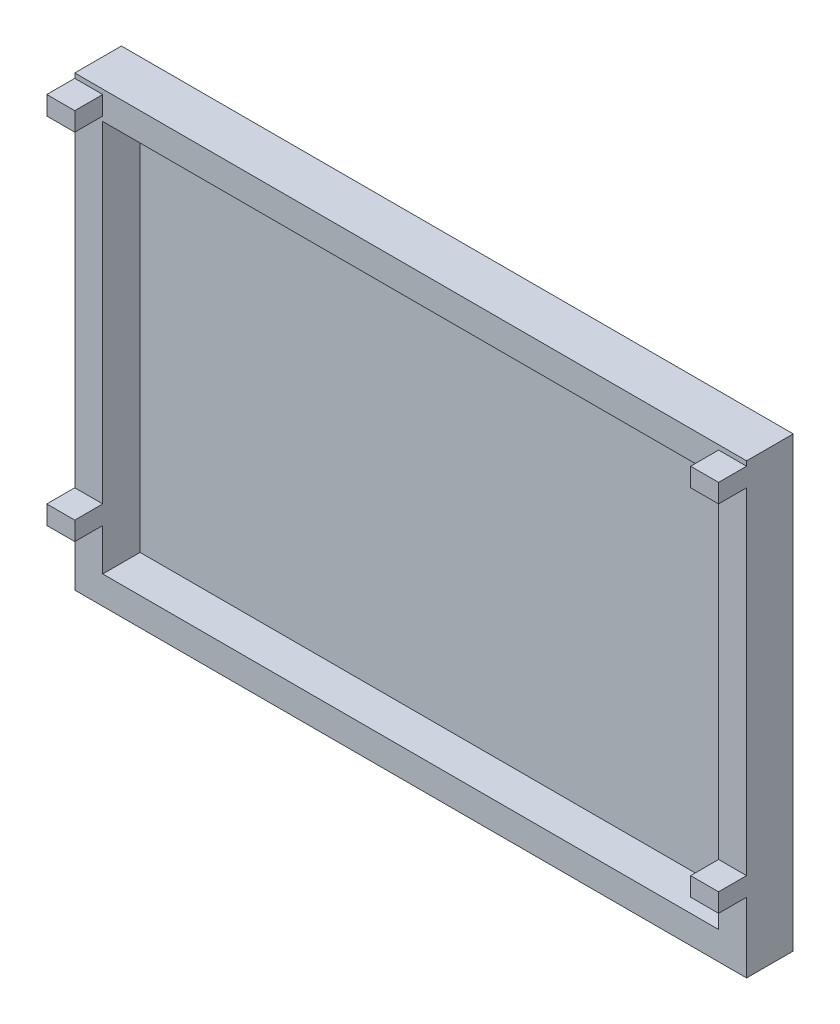
ISO-10303-21;
HEADER;
FILE_DESCRIPTION(('STEP AP214'),'2;1');
FILE_NAME('part.step','',(''),(''),'','','');
FILE_SCHEMA(('AUTOMOTIVE_DESIGN { 1 0 10303 214 1 1 1 1 }'));
ENDSEC;
DATA;
#1=APPLICATION_CONTEXT('core data for automotive mechanical design processes');
#2=APPLICATION_PROTOCOL_DEFINITION('international standard','automotive_design',2000,#1);
#3=PRODUCT_CONTEXT('',#1,'mechanical');
#4=PRODUCT('Part','Part','',(#3));
#5=PRODUCT_RELATED_PRODUCT_CATEGORY('part','',(#4));
#6=PRODUCT_DEFINITION_FORMATION('','',#4);
#7=PRODUCT_DEFINITION_CONTEXT('part definition',#1,'design');
#8=PRODUCT_DEFINITION('design','',#6,#7);
#9=PRODUCT_DEFINITION_SHAPE('','',#8);
#10=(LENGTH_UNIT() NAMED_UNIT(*) SI_UNIT(.MILLI.,.METRE.));
#11=(NAMED_UNIT(*) PLANE_ANGLE_UNIT() SI_UNIT($,.RADIAN.));
#12=(NAMED_UNIT(*) SI_UNIT($,.STERADIAN.) SOLID_ANGLE_UNIT());
#13=UNCERTAINTY_MEASURE_WITH_UNIT(LENGTH_MEASURE(1.E-05),#10,'distance_accuracy_value','');
#14=(GEOMETRIC_REPRESENTATION_CONTEXT(3) GLOBAL_UNCERTAINTY_ASSIGNED_CONTEXT((#13)) GLOBAL_UNIT_ASSIGNED_CONTEXT((#10,
#11,#12)) REPRESENTATION_CONTEXT('',''));
#15=CARTESIAN_POINT('',(0.,0.,0.));
#16=DIRECTION('',(0.,0.,1.));
#17=DIRECTION('',(1.,0.,0.));
#18=AXIS2_PLACEMENT_3D('',#15,#16,#17);
#19=CARTESIAN_POINT('',(0.,0.,127.));
#20=DIRECTION('',(0.,0.,1.));
#21=DIRECTION('',(1.,0.,0.));
#22=AXIS2_PLACEMENT_3D('',#19,#20,#21);
#23=PLANE('',#22);
#24=DIRECTION('',(0.,1.,0.));
#25=VECTOR('',#24,1.);
#26=CARTESIAN_POINT('',(1828.8,0.,127.));
#27=LINE('',#26,#25);
#28=CARTESIAN_POINT('',(1828.8,0.,127.));
#29=VERTEX_POINT('',#28);
#30=CARTESIAN_POINT('',(1828.8,190.5,127.));
#31=VERTEX_POINT('',#30);
#32=EDGE_CURVE('E354',#29,#31,#27,.T.);
#33=ORIENTED_EDGE('',*,*,#32,.T.);
#34=DIRECTION('',(1.,0.,0.));
#35=VECTOR('',#34,1.);
#36=CARTESIAN_POINT('',(1752.6,190.5,127.));
#37=LINE('',#36,#35);
#38=CARTESIAN_POINT('',(1752.6,190.5,127.));
#39=VERTEX_POINT('',#38);
#40=EDGE_CURVE('E556',#39,#31,#37,.T.);
#41=ORIENTED_EDGE('',*,*,#40,.F.);
#42=DIRECTION('',(0.,1.,0.));
#43=VECTOR('',#42,1.);
#44=CARTESIAN_POINT('',(1752.6,1143.,127.));
#45=LINE('',#44,#43);
#46=CARTESIAN_POINT('',(1752.6,76.2,127.));
#47=VERTEX_POINT('',#46);
#48=EDGE_CURVE('E218',#47,#39,#45,.T.);
#49=ORIENTED_EDGE('',*,*,#48,.F.);
#50=DIRECTION('',(1.,0.,0.));
#51=VECTOR('',#50,1.);
#52=CARTESIAN_POINT('',(1752.6,76.2,127.));
#53=LINE('',#52,#51);
#54=CARTESIAN_POINT('',(76.2000000000003,76.1999999999998,127.));
#55=VERTEX_POINT('',#54);
#56=EDGE_CURVE('E319',#55,#47,#53,.T.);
#57=ORIENTED_EDGE('',*,*,#56,.F.);
#58=DIRECTION('',(0.,-1.,0.));
#59=VECTOR('',#58,1.);
#60=CARTESIAN_POINT('',(76.2,1143.,127.));
#61=LINE('',#60,#59);
#62=CARTESIAN_POINT('',(76.2000000000002,190.5,127.));
#63=VERTEX_POINT('',#62);
#64=EDGE_CURVE('E333',#63,#55,#61,.T.);
#65=ORIENTED_EDGE('',*,*,#64,.F.);
#66=DIRECTION('',(1.,0.,0.));
#67=VECTOR('',#66,1.);
#68=CARTESIAN_POINT('',(0.,190.5,127.));
#69=LINE('',#68,#67);
#70=CARTESIAN_POINT('',(0.,190.5,127.));
#71=VERTEX_POINT('',#70);
#72=EDGE_CURVE('E219',#71,#63,#69,.T.);
#73=ORIENTED_EDGE('',*,*,#72,.F.);
#74=DIRECTION('',(0.,1.,0.));
#75=VECTOR('',#74,1.);
#76=CARTESIAN_POINT('',(0.,0.,127.));
#77=LINE('',#76,#75);
#78=CARTESIAN_POINT('',(0.,0.,127.));
#79=VERTEX_POINT('',#78);
#80=EDGE_CURVE('E369',#79,#71,#77,.T.);
#81=ORIENTED_EDGE('',*,*,#80,.F.);
#82=DIRECTION('',(1.,0.,0.));
#83=VECTOR('',#82,1.);
#84=CARTESIAN_POINT('',(0.,0.,127.));
#85=LINE('',#84,#83);
#86=EDGE_CURVE('E349',#79,#29,#85,.T.);
#87=ORIENTED_EDGE('',*,*,#86,.T.);
#88=EDGE_LOOP('',(#33,#41,#49,#57,#65,#73,#81,#87));
#89=FACE_BOUND('',#88,.T.);
#90=ADVANCED_FACE('F32',(#89),#23,.T.);
#91=CARTESIAN_POINT('',(1752.6,241.3,127.));
#92=VERTEX_POINT('',#91);
#93=CARTESIAN_POINT('',(1752.6,1143.,127.));
#94=VERTEX_POINT('',#93);
#95=EDGE_CURVE('E313',#92,#94,#45,.T.);
#96=ORIENTED_EDGE('',*,*,#95,.F.);
#97=DIRECTION('',(-1.,0.,0.));
#98=VECTOR('',#97,1.);
#99=CARTESIAN_POINT('',(1752.6,241.3,127.));
#100=LINE('',#99,#98);
#101=CARTESIAN_POINT('',(1828.8,241.3,127.));
#102=VERTEX_POINT('',#101);
#103=EDGE_CURVE('E213',#102,#92,#100,.T.);
#104=ORIENTED_EDGE('',*,*,#103,.F.);
#105=CARTESIAN_POINT('',(1828.8,1155.7,127.));
#106=VERTEX_POINT('',#105);
#107=EDGE_CURVE('E358',#102,#106,#27,.T.);
#108=ORIENTED_EDGE('',*,*,#107,.T.);
#109=DIRECTION('',(1.,0.,0.));
#110=VECTOR('',#109,1.);
#111=CARTESIAN_POINT('',(1752.6,1155.7,127.));
#112=LINE('',#111,#110);
#113=CARTESIAN_POINT('',(1752.6,1155.7,127.));
#114=VERTEX_POINT('',#113);
#115=EDGE_CURVE('E259',#114,#106,#112,.T.);
#116=ORIENTED_EDGE('',*,*,#115,.F.);
#117=DIRECTION('',(0.,-1.,0.));
#118=VECTOR('',#117,1.);
#119=CARTESIAN_POINT('',(1752.6,1206.5,127.));
#120=LINE('',#119,#118);
#121=CARTESIAN_POINT('',(1752.6,1206.5,127.));
#122=VERTEX_POINT('',#121);
#123=EDGE_CURVE('E245',#122,#114,#120,.T.);
#124=ORIENTED_EDGE('',*,*,#123,.F.);
#125=DIRECTION('',(-1.,0.,0.));
#126=VECTOR('',#125,1.);
#127=CARTESIAN_POINT('',(1752.6,1206.5,127.));
#128=LINE('',#127,#126);
#129=CARTESIAN_POINT('',(1828.8,1206.5,127.));
#130=VERTEX_POINT('',#129);
#131=EDGE_CURVE('E250',#130,#122,#128,.T.);
#132=ORIENTED_EDGE('',*,*,#131,.F.);
#133=CARTESIAN_POINT('',(1828.8,1219.2,127.));
#134=VERTEX_POINT('',#133);
#135=EDGE_CURVE('E352',#130,#134,#27,.T.);
#136=ORIENTED_EDGE('',*,*,#135,.T.);
#137=DIRECTION('',(1.,0.,0.));
#138=VECTOR('',#137,1.);
#139=CARTESIAN_POINT('',(0.,1219.2,127.));
#140=LINE('',#139,#138);
#141=CARTESIAN_POINT('',(0.,1219.2,127.));
#142=VERTEX_POINT('',#141);
#143=EDGE_CURVE('E357',#142,#134,#140,.T.);
#144=ORIENTED_EDGE('',*,*,#143,.F.);
#145=CARTESIAN_POINT('',(0.,1206.5,127.));
#146=VERTEX_POINT('',#145);
#147=EDGE_CURVE('E360',#146,#142,#77,.T.);
#148=ORIENTED_EDGE('',*,*,#147,.F.);
#149=DIRECTION('',(-1.,0.,0.));
#150=VECTOR('',#149,1.);
#151=CARTESIAN_POINT('',(0.,1206.5,127.));
#152=LINE('',#151,#150);
#153=CARTESIAN_POINT('',(76.2,1206.5,127.));
#154=VERTEX_POINT('',#153);
#155=EDGE_CURVE('E277',#154,#146,#152,.T.);
#156=ORIENTED_EDGE('',*,*,#155,.F.);
#157=DIRECTION('',(0.,1.,0.));
#158=VECTOR('',#157,1.);
#159=CARTESIAN_POINT('',(76.2,1206.5,127.));
#160=LINE('',#159,#158);
#161=CARTESIAN_POINT('',(76.2,1155.7,127.));
#162=VERTEX_POINT('',#161);
#163=EDGE_CURVE('E284',#162,#154,#160,.T.);
#164=ORIENTED_EDGE('',*,*,#163,.F.);
#165=DIRECTION('',(1.,0.,0.));
#166=VECTOR('',#165,1.);
#167=CARTESIAN_POINT('',(0.,1155.7,127.));
#168=LINE('',#167,#166);
#169=CARTESIAN_POINT('',(0.,1155.7,127.));
#170=VERTEX_POINT('',#169);
#171=EDGE_CURVE('E272',#170,#162,#168,.T.);
#172=ORIENTED_EDGE('',*,*,#171,.F.);
#173=CARTESIAN_POINT('',(0.,241.3,127.));
#174=VERTEX_POINT('',#173);
#175=EDGE_CURVE('E36',#174,#170,#77,.T.);
#176=ORIENTED_EDGE('',*,*,#175,.F.);
#177=DIRECTION('',(-1.,0.,0.));
#178=VECTOR('',#177,1.);
#179=CARTESIAN_POINT('',(0.,241.3,127.));
#180=LINE('',#179,#178);
#181=CARTESIAN_POINT('',(76.2,241.3,127.));
#182=VERTEX_POINT('',#181);
#183=EDGE_CURVE('E221',#182,#174,#180,.T.);
#184=ORIENTED_EDGE('',*,*,#183,.F.);
#185=CARTESIAN_POINT('',(76.2,1143.,127.));
#186=VERTEX_POINT('',#185);
#187=EDGE_CURVE('E334',#186,#182,#61,.T.);
#188=ORIENTED_EDGE('',*,*,#187,.F.);
#189=DIRECTION('',(-1.,0.,0.));
#190=VECTOR('',#189,1.);
#191=CARTESIAN_POINT('',(1752.6,1143.,127.));
#192=LINE('',#191,#190);
#193=EDGE_CURVE('E330',#94,#186,#192,.T.);
#194=ORIENTED_EDGE('',*,*,#193,.F.);
#195=EDGE_LOOP('',(#96,#104,#108,#116,#124,#132,#136,#144,#148,#156,#164,#172,#176,#184,#188,#194));
#196=FACE_BOUND('',#195,.T.);
#197=ADVANCED_FACE('F410',(#196),#23,.T.);
#198=CARTESIAN_POINT('',(0.,0.,127.));
#199=DIRECTION('',(0.,1.,0.));
#200=DIRECTION('',(0.,0.,1.));
#201=AXIS2_PLACEMENT_3D('',#198,#199,#200);
#202=PLANE('',#201);
#203=DIRECTION('',(1.,0.,0.));
#204=VECTOR('',#203,1.);
#205=CARTESIAN_POINT('',(0.,0.,0.));
#206=LINE('',#205,#204);
#207=CARTESIAN_POINT('',(0.,0.,0.));
#208=VERTEX_POINT('',#207);
#209=CARTESIAN_POINT('',(1828.8,0.,0.));
#210=VERTEX_POINT('',#209);
#211=EDGE_CURVE('E341',#208,#210,#206,.T.);
#212=ORIENTED_EDGE('',*,*,#211,.T.);
#213=DIRECTION('',(0.,0.,-1.));
#214=VECTOR('',#213,1.);
#215=CARTESIAN_POINT('',(1828.8,0.,127.));
#216=LINE('',#215,#214);
#217=EDGE_CURVE('E11',#29,#210,#216,.T.);
#218=ORIENTED_EDGE('',*,*,#217,.F.);
#219=ORIENTED_EDGE('',*,*,#86,.F.);
#220=DIRECTION('',(0.,0.,-1.));
#221=VECTOR('',#220,1.);
#222=CARTESIAN_POINT('',(0.,0.,127.));
#223=LINE('',#222,#221);
#224=EDGE_CURVE('E371',#79,#208,#223,.T.);
#225=ORIENTED_EDGE('',*,*,#224,.T.);
#226=EDGE_LOOP('',(#212,#218,#219,#225));
#227=FACE_BOUND('',#226,.T.);
#228=ADVANCED_FACE('F34',(#227),#202,.F.);
#229=CARTESIAN_POINT('',(1828.8,0.,127.));
#230=DIRECTION('',(-1.,0.,0.));
#231=DIRECTION('',(0.,0.,1.));
#232=AXIS2_PLACEMENT_3D('',#229,#230,#231);
#233=PLANE('',#232);
#234=DIRECTION('',(0.,1.,0.));
#235=VECTOR('',#234,1.);
#236=CARTESIAN_POINT('',(1828.8,0.,0.));
#237=LINE('',#236,#235);
#238=CARTESIAN_POINT('',(1828.8,1219.2,0.));
#239=VERTEX_POINT('',#238);
#240=EDGE_CURVE('E381',#210,#239,#237,.T.);
#241=ORIENTED_EDGE('',*,*,#240,.T.);
#242=DIRECTION('',(0.,0.,-1.));
#243=VECTOR('',#242,1.);
#244=CARTESIAN_POINT('',(1828.8,1219.2,127.));
#245=LINE('',#244,#243);
#246=EDGE_CURVE('E42',#134,#239,#245,.T.);
#247=ORIENTED_EDGE('',*,*,#246,.F.);
#248=ORIENTED_EDGE('',*,*,#135,.F.);
#249=DIRECTION('',(0.,0.,-1.));
#250=VECTOR('',#249,1.);
#251=CARTESIAN_POINT('',(1828.8,1206.5,203.2));
#252=LINE('',#251,#250);
#253=CARTESIAN_POINT('',(1828.8,1206.5,203.2));
#254=VERTEX_POINT('',#253);
#255=EDGE_CURVE('E265',#254,#130,#252,.T.);
#256=ORIENTED_EDGE('',*,*,#255,.F.);
#257=DIRECTION('',(0.,1.,0.));
#258=VECTOR('',#257,1.);
#259=CARTESIAN_POINT('',(1828.8,1206.5,203.2));
#260=LINE('',#259,#258);
#261=CARTESIAN_POINT('',(1828.8,1155.7,203.2));
#262=VERTEX_POINT('',#261);
#263=EDGE_CURVE('E252',#262,#254,#260,.T.);
#264=ORIENTED_EDGE('',*,*,#263,.F.);
#265=DIRECTION('',(0.,0.,-1.));
#266=VECTOR('',#265,1.);
#267=CARTESIAN_POINT('',(1828.8,1155.7,203.2));
#268=LINE('',#267,#266);
#269=EDGE_CURVE('E267',#262,#106,#268,.T.);
#270=ORIENTED_EDGE('',*,*,#269,.T.);
#271=ORIENTED_EDGE('',*,*,#107,.F.);
#272=DIRECTION('',(0.,0.,-1.));
#273=VECTOR('',#272,1.);
#274=CARTESIAN_POINT('',(1828.8,241.3,203.2));
#275=LINE('',#274,#273);
#276=CARTESIAN_POINT('',(1828.8,241.3,203.2));
#277=VERTEX_POINT('',#276);
#278=EDGE_CURVE('E223',#277,#102,#275,.T.);
#279=ORIENTED_EDGE('',*,*,#278,.F.);
#280=DIRECTION('',(0.,1.,0.));
#281=VECTOR('',#280,1.);
#282=CARTESIAN_POINT('',(1828.8,241.3,203.2));
#283=LINE('',#282,#281);
#284=CARTESIAN_POINT('',(1828.8,190.5,203.2));
#285=VERTEX_POINT('',#284);
#286=EDGE_CURVE('E207',#285,#277,#283,.T.);
#287=ORIENTED_EDGE('',*,*,#286,.F.);
#288=DIRECTION('',(0.,0.,-1.));
#289=VECTOR('',#288,1.);
#290=CARTESIAN_POINT('',(1828.8,190.5,203.2));
#291=LINE('',#290,#289);
#292=EDGE_CURVE('E204',#285,#31,#291,.T.);
#293=ORIENTED_EDGE('',*,*,#292,.T.);
#294=ORIENTED_EDGE('',*,*,#32,.F.);
#295=ORIENTED_EDGE('',*,*,#217,.T.);
#296=EDGE_LOOP('',(#241,#247,#248,#256,#264,#270,#271,#279,#287,#293,#294,#295));
#297=FACE_BOUND('',#296,.T.);
#298=ADVANCED_FACE('F400',(#297),#233,.F.);
#299=CARTESIAN_POINT('',(0.,1219.2,127.));
#300=DIRECTION('',(0.,1.,0.));
#301=DIRECTION('',(0.,0.,1.));
#302=AXIS2_PLACEMENT_3D('',#299,#300,#301);
#303=PLANE('',#302);
#304=DIRECTION('',(1.,0.,0.));
#305=VECTOR('',#304,1.);
#306=CARTESIAN_POINT('',(0.,1219.2,0.));
#307=LINE('',#306,#305);
#308=CARTESIAN_POINT('',(0.,1219.2,0.));
#309=VERTEX_POINT('',#308);
#310=EDGE_CURVE('E379',#309,#239,#307,.T.);
#311=ORIENTED_EDGE('',*,*,#310,.F.);
#312=DIRECTION('',(0.,0.,-1.));
#313=VECTOR('',#312,1.);
#314=CARTESIAN_POINT('',(0.,1219.2,127.));
#315=LINE('',#314,#313);
#316=EDGE_CURVE('E374',#142,#309,#315,.T.);
#317=ORIENTED_EDGE('',*,*,#316,.F.);
#318=ORIENTED_EDGE('',*,*,#143,.T.);
#319=ORIENTED_EDGE('',*,*,#246,.T.);
#320=EDGE_LOOP('',(#311,#317,#318,#319));
#321=FACE_BOUND('',#320,.T.);
#322=ADVANCED_FACE('F398',(#321),#303,.T.);
#323=CARTESIAN_POINT('',(0.,0.,127.));
#324=DIRECTION('',(-1.,0.,0.));
#325=DIRECTION('',(0.,0.,1.));
#326=AXIS2_PLACEMENT_3D('',#323,#324,#325);
#327=PLANE('',#326);
#328=DIRECTION('',(0.,1.,0.));
#329=VECTOR('',#328,1.);
#330=CARTESIAN_POINT('',(0.,0.,0.));
#331=LINE('',#330,#329);
#332=EDGE_CURVE('E353',#208,#309,#331,.T.);
#333=ORIENTED_EDGE('',*,*,#332,.F.);
#334=ORIENTED_EDGE('',*,*,#224,.F.);
#335=ORIENTED_EDGE('',*,*,#80,.T.);
#336=DIRECTION('',(0.,0.,-1.));
#337=VECTOR('',#336,1.);
#338=CARTESIAN_POINT('',(0.,190.5,203.2));
#339=LINE('',#338,#337);
#340=CARTESIAN_POINT('',(0.,190.5,203.2));
#341=VERTEX_POINT('',#340);
#342=EDGE_CURVE('E243',#341,#71,#339,.T.);
#343=ORIENTED_EDGE('',*,*,#342,.F.);
#344=DIRECTION('',(0.,-1.,0.));
#345=VECTOR('',#344,1.);
#346=CARTESIAN_POINT('',(0.,241.3,203.2));
#347=LINE('',#346,#345);
#348=CARTESIAN_POINT('',(0.,241.3,203.2));
#349=VERTEX_POINT('',#348);
#350=EDGE_CURVE('E227',#349,#341,#347,.T.);
#351=ORIENTED_EDGE('',*,*,#350,.F.);
#352=DIRECTION('',(0.,0.,-1.));
#353=VECTOR('',#352,1.);
#354=CARTESIAN_POINT('',(0.,241.3,203.2));
#355=LINE('',#354,#353);
#356=EDGE_CURVE('E235',#349,#174,#355,.T.);
#357=ORIENTED_EDGE('',*,*,#356,.T.);
#358=ORIENTED_EDGE('',*,*,#175,.T.);
#359=DIRECTION('',(0.,0.,-1.));
#360=VECTOR('',#359,1.);
#361=CARTESIAN_POINT('',(0.,1155.7,203.2));
#362=LINE('',#361,#360);
#363=CARTESIAN_POINT('',(0.,1155.7,203.2));
#364=VERTEX_POINT('',#363);
#365=EDGE_CURVE('E308',#364,#170,#362,.T.);
#366=ORIENTED_EDGE('',*,*,#365,.F.);
#367=DIRECTION('',(0.,-1.,0.));
#368=VECTOR('',#367,1.);
#369=CARTESIAN_POINT('',(0.,1206.5,203.2));
#370=LINE('',#369,#368);
#371=CARTESIAN_POINT('',(0.,1206.5,203.2));
#372=VERTEX_POINT('',#371);
#373=EDGE_CURVE('E273',#372,#364,#370,.T.);
#374=ORIENTED_EDGE('',*,*,#373,.F.);
#375=DIRECTION('',(0.,0.,-1.));
#376=VECTOR('',#375,1.);
#377=CARTESIAN_POINT('',(0.,1206.5,203.2));
#378=LINE('',#377,#376);
#379=EDGE_CURVE('E283',#372,#146,#378,.T.);
#380=ORIENTED_EDGE('',*,*,#379,.T.);
#381=ORIENTED_EDGE('',*,*,#147,.T.);
#382=ORIENTED_EDGE('',*,*,#316,.T.);
#383=EDGE_LOOP('',(#333,#334,#335,#343,#351,#357,#358,#366,#374,#380,#381,#382));
#384=FACE_BOUND('',#383,.T.);
#385=ADVANCED_FACE('F393',(#384),#327,.T.);
#386=CARTESIAN_POINT('',(0.,0.,0.));
#387=DIRECTION('',(0.,0.,1.));
#388=DIRECTION('',(1.,0.,0.));
#389=AXIS2_PLACEMENT_3D('',#386,#387,#388);
#390=PLANE('',#389);
#391=ORIENTED_EDGE('',*,*,#211,.F.);
#392=ORIENTED_EDGE('',*,*,#332,.T.);
#393=ORIENTED_EDGE('',*,*,#310,.T.);
#394=ORIENTED_EDGE('',*,*,#240,.F.);
#395=EDGE_LOOP('',(#391,#392,#393,#394));
#396=FACE_BOUND('',#395,.T.);
#397=ADVANCED_FACE('F392',(#396),#390,.F.);
#398=CARTESIAN_POINT('',(1752.6,1143.,25.4));
#399=DIRECTION('',(1.,0.,0.));
#400=DIRECTION('',(0.,1.,0.));
#401=AXIS2_PLACEMENT_3D('',#398,#399,#400);
#402=PLANE('',#401);
#403=ORIENTED_EDGE('',*,*,#48,.T.);
#404=DIRECTION('',(0.,0.,-1.));
#405=VECTOR('',#404,1.);
#406=CARTESIAN_POINT('',(1752.6,190.5,203.2));
#407=LINE('',#406,#405);
#408=CARTESIAN_POINT('',(1752.6,190.5,203.2));
#409=VERTEX_POINT('',#408);
#410=EDGE_CURVE('E201',#409,#39,#407,.T.);
#411=ORIENTED_EDGE('',*,*,#410,.F.);
#412=DIRECTION('',(0.,-1.,0.));
#413=VECTOR('',#412,1.);
#414=CARTESIAN_POINT('',(1752.6,241.3,203.2));
#415=LINE('',#414,#413);
#416=CARTESIAN_POINT('',(1752.6,241.3,203.2));
#417=VERTEX_POINT('',#416);
#418=EDGE_CURVE('E208',#417,#409,#415,.T.);
#419=ORIENTED_EDGE('',*,*,#418,.F.);
#420=DIRECTION('',(0.,0.,-1.));
#421=VECTOR('',#420,1.);
#422=CARTESIAN_POINT('',(1752.6,241.3,203.2));
#423=LINE('',#422,#421);
#424=EDGE_CURVE('E50',#417,#92,#423,.T.);
#425=ORIENTED_EDGE('',*,*,#424,.T.);
#426=ORIENTED_EDGE('',*,*,#95,.T.);
#427=DIRECTION('',(0.,0.,1.));
#428=VECTOR('',#427,1.);
#429=CARTESIAN_POINT('',(1752.6,1143.,25.4));
#430=LINE('',#429,#428);
#431=CARTESIAN_POINT('',(1752.6,1143.,25.4));
#432=VERTEX_POINT('',#431);
#433=EDGE_CURVE('E328',#432,#94,#430,.T.);
#434=ORIENTED_EDGE('',*,*,#433,.F.);
#435=DIRECTION('',(0.,1.,0.));
#436=VECTOR('',#435,1.);
#437=CARTESIAN_POINT('',(1752.6,1143.,25.4));
#438=LINE('',#437,#436);
#439=CARTESIAN_POINT('',(1752.6,76.2,25.4));
#440=VERTEX_POINT('',#439);
#441=EDGE_CURVE('E315',#440,#432,#438,.T.);
#442=ORIENTED_EDGE('',*,*,#441,.F.);
#443=DIRECTION('',(0.,0.,1.));
#444=VECTOR('',#443,1.);
#445=CARTESIAN_POINT('',(1752.6,76.2,25.4));
#446=LINE('',#445,#444);
#447=EDGE_CURVE('E339',#440,#47,#446,.T.);
#448=ORIENTED_EDGE('',*,*,#447,.T.);
#449=EDGE_LOOP('',(#403,#411,#419,#425,#426,#434,#442,#448));
#450=FACE_BOUND('',#449,.T.);
#451=ADVANCED_FACE('F216',(#450),#402,.F.);
#452=CARTESIAN_POINT('',(1752.6,76.2,25.4));
#453=DIRECTION('',(0.,-1.,0.));
#454=DIRECTION('',(1.,0.,0.));
#455=AXIS2_PLACEMENT_3D('',#452,#453,#454);
#456=PLANE('',#455);
#457=ORIENTED_EDGE('',*,*,#56,.T.);
#458=ORIENTED_EDGE('',*,*,#447,.F.);
#459=DIRECTION('',(1.,0.,0.));
#460=VECTOR('',#459,1.);
#461=CARTESIAN_POINT('',(1752.6,76.2,25.4));
#462=LINE('',#461,#460);
#463=CARTESIAN_POINT('',(76.2000000000003,76.1999999999998,25.4));
#464=VERTEX_POINT('',#463);
#465=EDGE_CURVE('E325',#464,#440,#462,.T.);
#466=ORIENTED_EDGE('',*,*,#465,.F.);
#467=DIRECTION('',(0.,0.,1.));
#468=VECTOR('',#467,1.);
#469=CARTESIAN_POINT('',(76.2000000000003,76.1999999999998,25.4));
#470=LINE('',#469,#468);
#471=EDGE_CURVE('E342',#464,#55,#470,.T.);
#472=ORIENTED_EDGE('',*,*,#471,.T.);
#473=EDGE_LOOP('',(#457,#458,#466,#472));
#474=FACE_BOUND('',#473,.T.);
#475=ADVANCED_FACE('F484',(#474),#456,.F.);
#476=CARTESIAN_POINT('',(76.2,1143.,25.4));
#477=DIRECTION('',(-1.,0.,0.));
#478=DIRECTION('',(0.,-1.,0.));
#479=AXIS2_PLACEMENT_3D('',#476,#477,#478);
#480=PLANE('',#479);
#481=ORIENTED_EDGE('',*,*,#187,.T.);
#482=DIRECTION('',(0.,0.,-1.));
#483=VECTOR('',#482,1.);
#484=CARTESIAN_POINT('',(76.2,241.3,203.2));
#485=LINE('',#484,#483);
#486=CARTESIAN_POINT('',(76.2,241.3,203.2));
#487=VERTEX_POINT('',#486);
#488=EDGE_CURVE('E240',#487,#182,#485,.T.);
#489=ORIENTED_EDGE('',*,*,#488,.F.);
#490=DIRECTION('',(0.,1.,0.));
#491=VECTOR('',#490,1.);
#492=CARTESIAN_POINT('',(76.2,241.3,203.2));
#493=LINE('',#492,#491);
#494=CARTESIAN_POINT('',(76.2,190.5,203.2));
#495=VERTEX_POINT('',#494);
#496=EDGE_CURVE('E232',#495,#487,#493,.T.);
#497=ORIENTED_EDGE('',*,*,#496,.F.);
#498=DIRECTION('',(0.,0.,-1.));
#499=VECTOR('',#498,1.);
#500=CARTESIAN_POINT('',(76.2,190.5,203.2));
#501=LINE('',#500,#499);
#502=EDGE_CURVE('E58',#495,#63,#501,.T.);
#503=ORIENTED_EDGE('',*,*,#502,.T.);
#504=ORIENTED_EDGE('',*,*,#64,.T.);
#505=ORIENTED_EDGE('',*,*,#471,.F.);
#506=DIRECTION('',(0.,-1.,0.));
#507=VECTOR('',#506,1.);
#508=CARTESIAN_POINT('',(76.2,1143.,25.4));
#509=LINE('',#508,#507);
#510=CARTESIAN_POINT('',(76.2,1143.,25.4));
#511=VERTEX_POINT('',#510);
#512=EDGE_CURVE('E322',#511,#464,#509,.T.);
#513=ORIENTED_EDGE('',*,*,#512,.F.);
#514=DIRECTION('',(0.,0.,1.));
#515=VECTOR('',#514,1.);
#516=CARTESIAN_POINT('',(76.2,1143.,25.4));
#517=LINE('',#516,#515);
#518=EDGE_CURVE('E345',#511,#186,#517,.T.);
#519=ORIENTED_EDGE('',*,*,#518,.T.);
#520=EDGE_LOOP('',(#481,#489,#497,#503,#504,#505,#513,#519));
#521=FACE_BOUND('',#520,.T.);
#522=ADVANCED_FACE('F491',(#521),#480,.F.);
#523=CARTESIAN_POINT('',(1752.6,1143.,25.4));
#524=DIRECTION('',(0.,1.,0.));
#525=DIRECTION('',(-1.,0.,0.));
#526=AXIS2_PLACEMENT_3D('',#523,#524,#525);
#527=PLANE('',#526);
#528=ORIENTED_EDGE('',*,*,#193,.T.);
#529=ORIENTED_EDGE('',*,*,#518,.F.);
#530=DIRECTION('',(-1.,0.,0.));
#531=VECTOR('',#530,1.);
#532=CARTESIAN_POINT('',(1752.6,1143.,25.4));
#533=LINE('',#532,#531);
#534=EDGE_CURVE('E318',#432,#511,#533,.T.);
#535=ORIENTED_EDGE('',*,*,#534,.F.);
#536=ORIENTED_EDGE('',*,*,#433,.T.);
#537=EDGE_LOOP('',(#528,#529,#535,#536));
#538=FACE_BOUND('',#537,.T.);
#539=ADVANCED_FACE('F495',(#538),#527,.F.);
#540=CARTESIAN_POINT('',(0.,0.,25.4));
#541=DIRECTION('',(0.,0.,-1.));
#542=DIRECTION('',(-1.,0.,0.));
#543=AXIS2_PLACEMENT_3D('',#540,#541,#542);
#544=PLANE('',#543);
#545=ORIENTED_EDGE('',*,*,#441,.T.);
#546=ORIENTED_EDGE('',*,*,#534,.T.);
#547=ORIENTED_EDGE('',*,*,#512,.T.);
#548=ORIENTED_EDGE('',*,*,#465,.T.);
#549=EDGE_LOOP('',(#545,#546,#547,#548));
#550=FACE_BOUND('',#549,.T.);
#551=ADVANCED_FACE('F565',(#550),#544,.F.);
#552=CARTESIAN_POINT('',(0.,1155.7,203.2));
#553=DIRECTION('',(0.,1.,0.));
#554=DIRECTION('',(0.,0.,1.));
#555=AXIS2_PLACEMENT_3D('',#552,#553,#554);
#556=PLANE('',#555);
#557=ORIENTED_EDGE('',*,*,#171,.T.);
#558=DIRECTION('',(0.,0.,-1.));
#559=VECTOR('',#558,1.);
#560=CARTESIAN_POINT('',(76.2,1155.7,203.2));
#561=LINE('',#560,#559);
#562=CARTESIAN_POINT('',(76.2,1155.7,203.2));
#563=VERTEX_POINT('',#562);
#564=EDGE_CURVE('E303',#563,#162,#561,.T.);
#565=ORIENTED_EDGE('',*,*,#564,.F.);
#566=DIRECTION('',(1.,0.,0.));
#567=VECTOR('',#566,1.);
#568=CARTESIAN_POINT('',(0.,1155.7,203.2));
#569=LINE('',#568,#567);
#570=EDGE_CURVE('E276',#364,#563,#569,.T.);
#571=ORIENTED_EDGE('',*,*,#570,.F.);
#572=ORIENTED_EDGE('',*,*,#365,.T.);
#573=EDGE_LOOP('',(#557,#565,#571,#572));
#574=FACE_BOUND('',#573,.T.);
#575=ADVANCED_FACE('F587',(#574),#556,.F.);
#576=CARTESIAN_POINT('',(76.2,1206.5,203.2));
#577=DIRECTION('',(-1.,0.,0.));
#578=DIRECTION('',(0.,0.,1.));
#579=AXIS2_PLACEMENT_3D('',#576,#577,#578);
#580=PLANE('',#579);
#581=ORIENTED_EDGE('',*,*,#163,.T.);
#582=DIRECTION('',(0.,0.,-1.));
#583=VECTOR('',#582,1.);
#584=CARTESIAN_POINT('',(76.2,1206.5,203.2));
#585=LINE('',#584,#583);
#586=CARTESIAN_POINT('',(76.2,1206.5,203.2));
#587=VERTEX_POINT('',#586);
#588=EDGE_CURVE('E289',#587,#154,#585,.T.);
#589=ORIENTED_EDGE('',*,*,#588,.F.);
#590=DIRECTION('',(0.,1.,0.));
#591=VECTOR('',#590,1.);
#592=CARTESIAN_POINT('',(76.2,1206.5,203.2));
#593=LINE('',#592,#591);
#594=EDGE_CURVE('E279',#563,#587,#593,.T.);
#595=ORIENTED_EDGE('',*,*,#594,.F.);
#596=ORIENTED_EDGE('',*,*,#564,.T.);
#597=EDGE_LOOP('',(#581,#589,#595,#596));
#598=FACE_BOUND('',#597,.T.);
#599=ADVANCED_FACE('F591',(#598),#580,.F.);
#600=CARTESIAN_POINT('',(0.,1206.5,203.2));
#601=DIRECTION('',(0.,-1.,0.));
#602=DIRECTION('',(0.,0.,-1.));
#603=AXIS2_PLACEMENT_3D('',#600,#601,#602);
#604=PLANE('',#603);
#605=ORIENTED_EDGE('',*,*,#155,.T.);
#606=ORIENTED_EDGE('',*,*,#379,.F.);
#607=DIRECTION('',(-1.,0.,0.));
#608=VECTOR('',#607,1.);
#609=CARTESIAN_POINT('',(0.,1206.5,203.2));
#610=LINE('',#609,#608);
#611=EDGE_CURVE('E281',#587,#372,#610,.T.);
#612=ORIENTED_EDGE('',*,*,#611,.F.);
#613=ORIENTED_EDGE('',*,*,#588,.T.);
#614=EDGE_LOOP('',(#605,#606,#612,#613));
#615=FACE_BOUND('',#614,.T.);
#616=ADVANCED_FACE('F590',(#615),#604,.F.);
#617=CARTESIAN_POINT('',(0.,0.,203.2));
#618=DIRECTION('',(0.,0.,1.));
#619=DIRECTION('',(1.,0.,0.));
#620=AXIS2_PLACEMENT_3D('',#617,#618,#619);
#621=PLANE('',#620);
#622=ORIENTED_EDGE('',*,*,#373,.T.);
#623=ORIENTED_EDGE('',*,*,#570,.T.);
#624=ORIENTED_EDGE('',*,*,#594,.T.);
#625=ORIENTED_EDGE('',*,*,#611,.T.);
#626=EDGE_LOOP('',(#622,#623,#624,#625));
#627=FACE_BOUND('',#626,.T.);
#628=ADVANCED_FACE('F589',(#627),#621,.T.);
#629=CARTESIAN_POINT('',(1752.6,1206.5,203.2));
#630=DIRECTION('',(1.,0.,0.));
#631=DIRECTION('',(0.,0.,-1.));
#632=AXIS2_PLACEMENT_3D('',#629,#630,#631);
#633=PLANE('',#632);
#634=ORIENTED_EDGE('',*,*,#123,.T.);
#635=DIRECTION('',(0.,0.,-1.));
#636=VECTOR('',#635,1.);
#637=CARTESIAN_POINT('',(1752.6,1155.7,203.2));
#638=LINE('',#637,#636);
#639=CARTESIAN_POINT('',(1752.6,1155.7,203.2));
#640=VERTEX_POINT('',#639);
#641=EDGE_CURVE('E270',#640,#114,#638,.T.);
#642=ORIENTED_EDGE('',*,*,#641,.F.);
#643=DIRECTION('',(0.,-1.,0.));
#644=VECTOR('',#643,1.);
#645=CARTESIAN_POINT('',(1752.6,1206.5,203.2));
#646=LINE('',#645,#644);
#647=CARTESIAN_POINT('',(1752.6,1206.5,203.2));
#648=VERTEX_POINT('',#647);
#649=EDGE_CURVE('E246',#648,#640,#646,.T.);
#650=ORIENTED_EDGE('',*,*,#649,.F.);
#651=DIRECTION('',(0.,0.,-1.));
#652=VECTOR('',#651,1.);
#653=CARTESIAN_POINT('',(1752.6,1206.5,203.2));
#654=LINE('',#653,#652);
#655=EDGE_CURVE('E256',#648,#122,#654,.T.);
#656=ORIENTED_EDGE('',*,*,#655,.T.);
#657=EDGE_LOOP('',(#634,#642,#650,#656));
#658=FACE_BOUND('',#657,.T.);
#659=ADVANCED_FACE('F422',(#658),#633,.F.);
#660=CARTESIAN_POINT('',(1752.6,1155.7,203.2));
#661=DIRECTION('',(0.,1.,0.));
#662=DIRECTION('',(0.,0.,1.));
#663=AXIS2_PLACEMENT_3D('',#660,#661,#662);
#664=PLANE('',#663);
#665=ORIENTED_EDGE('',*,*,#115,.T.);
#666=ORIENTED_EDGE('',*,*,#269,.F.);
#667=DIRECTION('',(1.,0.,0.));
#668=VECTOR('',#667,1.);
#669=CARTESIAN_POINT('',(1752.6,1155.7,203.2));
#670=LINE('',#669,#668);
#671=EDGE_CURVE('E249',#640,#262,#670,.T.);
#672=ORIENTED_EDGE('',*,*,#671,.F.);
#673=ORIENTED_EDGE('',*,*,#641,.T.);
#674=EDGE_LOOP('',(#665,#666,#672,#673));
#675=FACE_BOUND('',#674,.T.);
#676=ADVANCED_FACE('F415',(#675),#664,.F.);
#677=CARTESIAN_POINT('',(1752.6,1206.5,203.2));
#678=DIRECTION('',(0.,-1.,0.));
#679=DIRECTION('',(0.,0.,-1.));
#680=AXIS2_PLACEMENT_3D('',#677,#678,#679);
#681=PLANE('',#680);
#682=ORIENTED_EDGE('',*,*,#131,.T.);
#683=ORIENTED_EDGE('',*,*,#655,.F.);
#684=DIRECTION('',(-1.,0.,0.));
#685=VECTOR('',#684,1.);
#686=CARTESIAN_POINT('',(1752.6,1206.5,203.2));
#687=LINE('',#686,#685);
#688=EDGE_CURVE('E254',#254,#648,#687,.T.);
#689=ORIENTED_EDGE('',*,*,#688,.F.);
#690=ORIENTED_EDGE('',*,*,#255,.T.);
#691=EDGE_LOOP('',(#682,#683,#689,#690));
#692=FACE_BOUND('',#691,.T.);
#693=ADVANCED_FACE('F424',(#692),#681,.F.);
#694=CARTESIAN_POINT('',(0.,0.,203.2));
#695=DIRECTION('',(0.,0.,1.));
#696=DIRECTION('',(1.,0.,0.));
#697=AXIS2_PLACEMENT_3D('',#694,#695,#696);
#698=PLANE('',#697);
#699=ORIENTED_EDGE('',*,*,#649,.T.);
#700=ORIENTED_EDGE('',*,*,#671,.T.);
#701=ORIENTED_EDGE('',*,*,#263,.T.);
#702=ORIENTED_EDGE('',*,*,#688,.T.);
#703=EDGE_LOOP('',(#699,#700,#701,#702));
#704=FACE_BOUND('',#703,.T.);
#705=ADVANCED_FACE('F418',(#704),#698,.T.);
#706=CARTESIAN_POINT('',(0.,190.5,203.2));
#707=DIRECTION('',(0.,1.,0.));
#708=DIRECTION('',(0.,0.,1.));
#709=AXIS2_PLACEMENT_3D('',#706,#707,#708);
#710=PLANE('',#709);
#711=ORIENTED_EDGE('',*,*,#72,.T.);
#712=ORIENTED_EDGE('',*,*,#502,.F.);
#713=DIRECTION('',(1.,0.,0.));
#714=VECTOR('',#713,1.);
#715=CARTESIAN_POINT('',(0.,190.5,203.2));
#716=LINE('',#715,#714);
#717=EDGE_CURVE('E230',#341,#495,#716,.T.);
#718=ORIENTED_EDGE('',*,*,#717,.F.);
#719=ORIENTED_EDGE('',*,*,#342,.T.);
#720=EDGE_LOOP('',(#711,#712,#718,#719));
#721=FACE_BOUND('',#720,.T.);
#722=ADVANCED_FACE('F431',(#721),#710,.F.);
#723=CARTESIAN_POINT('',(0.,241.3,203.2));
#724=DIRECTION('',(0.,-1.,0.));
#725=DIRECTION('',(0.,0.,-1.));
#726=AXIS2_PLACEMENT_3D('',#723,#724,#725);
#727=PLANE('',#726);
#728=ORIENTED_EDGE('',*,*,#183,.T.);
#729=ORIENTED_EDGE('',*,*,#356,.F.);
#730=DIRECTION('',(-1.,0.,0.));
#731=VECTOR('',#730,1.);
#732=CARTESIAN_POINT('',(0.,241.3,203.2));
#733=LINE('',#732,#731);
#734=EDGE_CURVE('E234',#487,#349,#733,.T.);
#735=ORIENTED_EDGE('',*,*,#734,.F.);
#736=ORIENTED_EDGE('',*,*,#488,.T.);
#737=EDGE_LOOP('',(#728,#729,#735,#736));
#738=FACE_BOUND('',#737,.T.);
#739=ADVANCED_FACE('F506',(#738),#727,.F.);
#740=CARTESIAN_POINT('',(0.,0.,203.2));
#741=DIRECTION('',(0.,0.,1.));
#742=DIRECTION('',(1.,0.,0.));
#743=AXIS2_PLACEMENT_3D('',#740,#741,#742);
#744=PLANE('',#743);
#745=ORIENTED_EDGE('',*,*,#350,.T.);
#746=ORIENTED_EDGE('',*,*,#717,.T.);
#747=ORIENTED_EDGE('',*,*,#496,.T.);
#748=ORIENTED_EDGE('',*,*,#734,.T.);
#749=EDGE_LOOP('',(#745,#746,#747,#748));
#750=FACE_BOUND('',#749,.T.);
#751=ADVANCED_FACE('F516',(#750),#744,.T.);
#752=CARTESIAN_POINT('',(1752.6,190.5,203.2));
#753=DIRECTION('',(0.,1.,0.));
#754=DIRECTION('',(0.,0.,1.));
#755=AXIS2_PLACEMENT_3D('',#752,#753,#754);
#756=PLANE('',#755);
#757=ORIENTED_EDGE('',*,*,#40,.T.);
#758=ORIENTED_EDGE('',*,*,#292,.F.);
#759=DIRECTION('',(1.,0.,0.));
#760=VECTOR('',#759,1.);
#761=CARTESIAN_POINT('',(1752.6,190.5,203.2));
#762=LINE('',#761,#760);
#763=EDGE_CURVE('E197',#409,#285,#762,.T.);
#764=ORIENTED_EDGE('',*,*,#763,.F.);
#765=ORIENTED_EDGE('',*,*,#410,.T.);
#766=EDGE_LOOP('',(#757,#758,#764,#765));
#767=FACE_BOUND('',#766,.T.);
#768=ADVANCED_FACE('F199',(#767),#756,.F.);
#769=CARTESIAN_POINT('',(1752.6,241.3,203.2));
#770=DIRECTION('',(0.,-1.,0.));
#771=DIRECTION('',(0.,0.,-1.));
#772=AXIS2_PLACEMENT_3D('',#769,#770,#771);
#773=PLANE('',#772);
#774=ORIENTED_EDGE('',*,*,#103,.T.);
#775=ORIENTED_EDGE('',*,*,#424,.F.);
#776=DIRECTION('',(-1.,0.,0.));
#777=VECTOR('',#776,1.);
#778=CARTESIAN_POINT('',(1752.6,241.3,203.2));
#779=LINE('',#778,#777);
#780=EDGE_CURVE('E212',#277,#417,#779,.T.);
#781=ORIENTED_EDGE('',*,*,#780,.F.);
#782=ORIENTED_EDGE('',*,*,#278,.T.);
#783=EDGE_LOOP('',(#774,#775,#781,#782));
#784=FACE_BOUND('',#783,.T.);
#785=ADVANCED_FACE('F535',(#784),#773,.F.);
#786=CARTESIAN_POINT('',(0.,0.,203.2));
#787=DIRECTION('',(0.,0.,1.));
#788=DIRECTION('',(1.,0.,0.));
#789=AXIS2_PLACEMENT_3D('',#786,#787,#788);
#790=PLANE('',#789);
#791=ORIENTED_EDGE('',*,*,#418,.T.);
#792=ORIENTED_EDGE('',*,*,#763,.T.);
#793=ORIENTED_EDGE('',*,*,#286,.T.);
#794=ORIENTED_EDGE('',*,*,#780,.T.);
#795=EDGE_LOOP('',(#791,#792,#793,#794));
#796=FACE_BOUND('',#795,.T.);
#797=ADVANCED_FACE('F210',(#796),#790,.T.);
#798=CLOSED_SHELL('',(#90,#197,#228,#298,#322,#385,#397,#451,#475,#522,#539,#551,#575,#599,#616,
#628,#659,#676,#693,#705,#722,#739,#751,#768,#785,#797));
#799=MANIFOLD_SOLID_BREP('B2',#798);
#800=ADVANCED_BREP_SHAPE_REPRESENTATION('',(#18,#799),#14);
#801=SHAPE_DEFINITION_REPRESENTATION(#9,#800);
ENDSEC;
END-ISO-10303-21;
